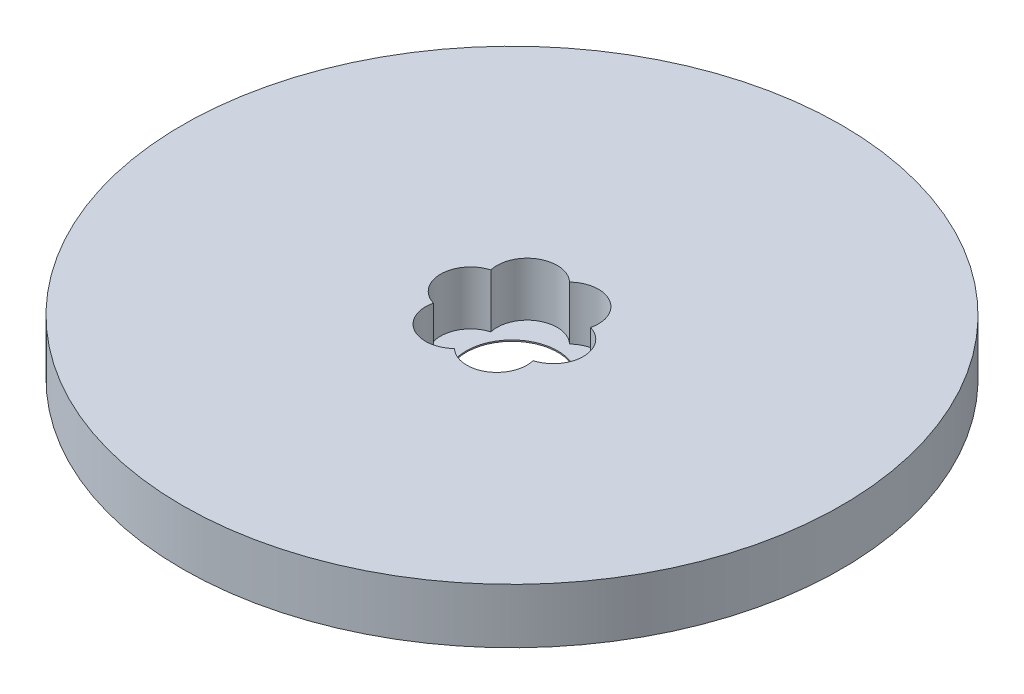
ISO-10303-21;
HEADER;
FILE_DESCRIPTION(('STEP AP214'),'2;1');
FILE_NAME('part.step','',(''),(''),'','','');
FILE_SCHEMA(('AUTOMOTIVE_DESIGN { 1 0 10303 214 1 1 1 1 }'));
ENDSEC;
DATA;
#1=APPLICATION_CONTEXT('core data for automotive mechanical design processes');
#2=APPLICATION_PROTOCOL_DEFINITION('international standard','automotive_design',2000,#1);
#3=PRODUCT_CONTEXT('',#1,'mechanical');
#4=PRODUCT('Part','Part','',(#3));
#5=PRODUCT_RELATED_PRODUCT_CATEGORY('part','',(#4));
#6=PRODUCT_DEFINITION_FORMATION('','',#4);
#7=PRODUCT_DEFINITION_CONTEXT('part definition',#1,'design');
#8=PRODUCT_DEFINITION('design','',#6,#7);
#9=PRODUCT_DEFINITION_SHAPE('','',#8);
#10=(LENGTH_UNIT() NAMED_UNIT(*) SI_UNIT(.MILLI.,.METRE.));
#11=(NAMED_UNIT(*) PLANE_ANGLE_UNIT() SI_UNIT($,.RADIAN.));
#12=(NAMED_UNIT(*) SI_UNIT($,.STERADIAN.) SOLID_ANGLE_UNIT());
#13=UNCERTAINTY_MEASURE_WITH_UNIT(LENGTH_MEASURE(1.E-05),#10,'distance_accuracy_value','');
#14=(GEOMETRIC_REPRESENTATION_CONTEXT(3) GLOBAL_UNCERTAINTY_ASSIGNED_CONTEXT((#13)) GLOBAL_UNIT_ASSIGNED_CONTEXT((#10,
#11,#12)) REPRESENTATION_CONTEXT('',''));
#15=CARTESIAN_POINT('',(0.,0.,0.));
#16=DIRECTION('',(0.,0.,1.));
#17=DIRECTION('',(1.,0.,0.));
#18=AXIS2_PLACEMENT_3D('',#15,#16,#17);
#19=CARTESIAN_POINT('',(0.,15.,0.));
#20=DIRECTION('',(0.,-1.,0.));
#21=DIRECTION('',(0.,0.,-1.));
#22=AXIS2_PLACEMENT_3D('',#19,#20,#21);
#23=CYLINDRICAL_SURFACE('',#22,12.5);
#24=CARTESIAN_POINT('',(0.,0.,0.));
#25=DIRECTION('',(0.,1.,0.));
#26=DIRECTION('',(0.,0.,1.));
#27=AXIS2_PLACEMENT_3D('',#24,#25,#26);
#28=CIRCLE('',#27,12.5);
#29=CARTESIAN_POINT('',(0.,0.,12.5));
#30=VERTEX_POINT('',#29);
#31=EDGE_CURVE('E142',#30,#30,#28,.T.);
#32=ORIENTED_EDGE('',*,*,#31,.F.);
#33=EDGE_LOOP('',(#32));
#34=FACE_BOUND('',#33,.T.);
#35=CARTESIAN_POINT('',(0.,0.338485779785127,0.));
#36=DIRECTION('',(0.,1.,0.));
#37=DIRECTION('',(0.,0.,1.));
#38=AXIS2_PLACEMENT_3D('',#35,#36,#37);
#39=CIRCLE('',#38,12.5);
#40=CARTESIAN_POINT('',(0.,0.338485779785127,12.5));
#41=VERTEX_POINT('',#40);
#42=EDGE_CURVE('E11',#41,#41,#39,.T.);
#43=ORIENTED_EDGE('',*,*,#42,.T.);
#44=EDGE_LOOP('',(#43));
#45=FACE_BOUND('',#44,.T.);
#46=ADVANCED_FACE('F39',(#34,#45),#23,.F.);
#47=CARTESIAN_POINT('',(0.,15.,0.));
#48=DIRECTION('',(0.,-1.,0.));
#49=DIRECTION('',(0.,0.,-1.));
#50=AXIS2_PLACEMENT_3D('',#47,#48,#49);
#51=CYLINDRICAL_SURFACE('',#50,90.);
#52=CARTESIAN_POINT('',(0.,15.,0.));
#53=DIRECTION('',(0.,1.,0.));
#54=DIRECTION('',(0.,0.,1.));
#55=AXIS2_PLACEMENT_3D('',#52,#53,#54);
#56=CIRCLE('',#55,90.);
#57=CARTESIAN_POINT('',(0.,15.,90.));
#58=VERTEX_POINT('',#57);
#59=EDGE_CURVE('E50',#58,#58,#56,.T.);
#60=ORIENTED_EDGE('',*,*,#59,.F.);
#61=EDGE_LOOP('',(#60));
#62=FACE_BOUND('',#61,.T.);
#63=CARTESIAN_POINT('',(0.,0.,0.));
#64=DIRECTION('',(0.,1.,0.));
#65=DIRECTION('',(0.,0.,1.));
#66=AXIS2_PLACEMENT_3D('',#63,#64,#65);
#67=CIRCLE('',#66,90.);
#68=CARTESIAN_POINT('',(0.,0.,90.));
#69=VERTEX_POINT('',#68);
#70=EDGE_CURVE('E150',#69,#69,#67,.T.);
#71=ORIENTED_EDGE('',*,*,#70,.T.);
#72=EDGE_LOOP('',(#71));
#73=FACE_BOUND('',#72,.T.);
#74=ADVANCED_FACE('F41',(#62,#73),#51,.T.);
#75=CARTESIAN_POINT('',(0.,15.,0.));
#76=DIRECTION('',(0.,1.,0.));
#77=DIRECTION('',(0.,0.,1.));
#78=AXIS2_PLACEMENT_3D('',#75,#76,#77);
#79=PLANE('',#78);
#80=CARTESIAN_POINT('',(-5.65166908655826,15.,9.78897800548534));
#81=DIRECTION('',(0.,1.,0.));
#82=DIRECTION('',(0.86602540378444,0.,0.499999999999998));
#83=AXIS2_PLACEMENT_3D('',#80,#81,#82);
#84=CIRCLE('',#83,8.19081502464406);
#85=CARTESIAN_POINT('',(-13.6118064528098,15.,7.85878011968683));
#86=VERTEX_POINT('',#85);
#87=CARTESIAN_POINT('',(0.,15.,15.7175602393736));
#88=VERTEX_POINT('',#87);
#89=EDGE_CURVE('E132',#86,#88,#84,.T.);
#90=ORIENTED_EDGE('',*,*,#89,.F.);
#91=CARTESIAN_POINT('',(-11.3033381731166,15.,0.));
#92=DIRECTION('',(0.,1.,0.));
#93=DIRECTION('',(0.,0.,1.));
#94=AXIS2_PLACEMENT_3D('',#91,#92,#93);
#95=CIRCLE('',#94,8.19081502464406);
#96=CARTESIAN_POINT('',(-13.6118064528099,15.,-7.85878011968679));
#97=VERTEX_POINT('',#96);
#98=EDGE_CURVE('E138',#97,#86,#95,.T.);
#99=ORIENTED_EDGE('',*,*,#98,.F.);
#100=CARTESIAN_POINT('',(-5.65166908655839,15.,-9.78897800548526));
#101=DIRECTION('',(0.,1.,0.));
#102=DIRECTION('',(-0.866025403784433,0.,0.50000000000001));
#103=AXIS2_PLACEMENT_3D('',#100,#101,#102);
#104=CIRCLE('',#103,8.19081502464406);
#105=CARTESIAN_POINT('',(-1.64798730217797E-13,15.,-15.7175602393736));
#106=VERTEX_POINT('',#105);
#107=EDGE_CURVE('E53',#106,#97,#104,.T.);
#108=ORIENTED_EDGE('',*,*,#107,.F.);
#109=CARTESIAN_POINT('',(5.65166908655819,15.,-9.78897800548538));
#110=DIRECTION('',(0.,1.,0.));
#111=DIRECTION('',(-0.866025403784443,0.,-0.499999999999992));
#112=AXIS2_PLACEMENT_3D('',#109,#110,#111);
#113=CIRCLE('',#112,8.19081502464406);
#114=CARTESIAN_POINT('',(13.6118064528097,15.,-7.85878011968686));
#115=VERTEX_POINT('',#114);
#116=EDGE_CURVE('E106',#115,#106,#113,.T.);
#117=ORIENTED_EDGE('',*,*,#116,.F.);
#118=CARTESIAN_POINT('',(11.3033381731166,15.,0.));
#119=DIRECTION('',(0.,1.,0.));
#120=DIRECTION('',(0.,0.,-1.));
#121=AXIS2_PLACEMENT_3D('',#118,#119,#120);
#122=CIRCLE('',#121,8.19081502464406);
#123=CARTESIAN_POINT('',(13.6118064528099,15.,7.85878011968681));
#124=VERTEX_POINT('',#123);
#125=EDGE_CURVE('E104',#124,#115,#122,.T.);
#126=ORIENTED_EDGE('',*,*,#125,.F.);
#127=CARTESIAN_POINT('',(5.65166908655833,15.,9.7889780054853));
#128=DIRECTION('',(0.,1.,0.));
#129=DIRECTION('',(0.866025403784436,0.,-0.500000000000004));
#130=AXIS2_PLACEMENT_3D('',#127,#128,#129);
#131=CIRCLE('',#130,8.19081502464406);
#132=EDGE_CURVE('E123',#88,#124,#131,.T.);
#133=ORIENTED_EDGE('',*,*,#132,.F.);
#134=EDGE_LOOP('',(#90,#99,#108,#117,#126,#133));
#135=FACE_BOUND('',#134,.T.);
#136=ORIENTED_EDGE('',*,*,#59,.T.);
#137=EDGE_LOOP('',(#136));
#138=FACE_BOUND('',#137,.T.);
#139=ADVANCED_FACE('F156',(#135,#138),#79,.T.);
#140=CARTESIAN_POINT('',(0.,0.,0.));
#141=DIRECTION('',(0.,1.,0.));
#142=DIRECTION('',(0.,0.,1.));
#143=AXIS2_PLACEMENT_3D('',#140,#141,#142);
#144=PLANE('',#143);
#145=ORIENTED_EDGE('',*,*,#31,.T.);
#146=EDGE_LOOP('',(#145));
#147=FACE_BOUND('',#146,.T.);
#148=ORIENTED_EDGE('',*,*,#70,.F.);
#149=EDGE_LOOP('',(#148));
#150=FACE_BOUND('',#149,.T.);
#151=ADVANCED_FACE('F153',(#147,#150),#144,.F.);
#152=CARTESIAN_POINT('',(-11.3033381731166,0.338485779785127,0.));
#153=DIRECTION('',(0.,1.,0.));
#154=DIRECTION('',(0.,0.,1.));
#155=AXIS2_PLACEMENT_3D('',#152,#153,#154);
#156=CYLINDRICAL_SURFACE('',#155,8.19081502464406);
#157=ORIENTED_EDGE('',*,*,#98,.T.);
#158=DIRECTION('',(0.,1.,0.));
#159=VECTOR('',#158,1.);
#160=CARTESIAN_POINT('',(-13.6118064528098,7.66924288989256,7.85878011968683));
#161=LINE('',#160,#159);
#162=CARTESIAN_POINT('',(-13.6118064528098,0.338485779785127,7.85878011968683));
#163=VERTEX_POINT('',#162);
#164=EDGE_CURVE('E65',#86,#163,#161,.F.);
#165=ORIENTED_EDGE('',*,*,#164,.T.);
#166=CARTESIAN_POINT('',(-11.3033381731166,0.338485779785127,0.));
#167=DIRECTION('',(0.,1.,0.));
#168=DIRECTION('',(0.,0.,1.));
#169=AXIS2_PLACEMENT_3D('',#166,#167,#168);
#170=CIRCLE('',#169,8.19081502464406);
#171=CARTESIAN_POINT('',(-13.6118064528099,0.338485779785127,-7.85878011968679));
#172=VERTEX_POINT('',#171);
#173=EDGE_CURVE('E139',#172,#163,#170,.T.);
#174=ORIENTED_EDGE('',*,*,#173,.F.);
#175=DIRECTION('',(0.,1.,0.));
#176=VECTOR('',#175,1.);
#177=CARTESIAN_POINT('',(-13.6118064528099,7.66924288989256,-7.85878011968679));
#178=LINE('',#177,#176);
#179=EDGE_CURVE('E114',#172,#97,#178,.T.);
#180=ORIENTED_EDGE('',*,*,#179,.T.);
#181=EDGE_LOOP('',(#157,#165,#174,#180));
#182=FACE_BOUND('',#181,.T.);
#183=ADVANCED_FACE('F154',(#182),#156,.F.);
#184=CARTESIAN_POINT('',(-11.3033381731166,0.338485779785127,0.));
#185=DIRECTION('',(0.,1.,0.));
#186=DIRECTION('',(0.,0.,1.));
#187=AXIS2_PLACEMENT_3D('',#184,#185,#186);
#188=PLANE('',#187);
#189=ORIENTED_EDGE('',*,*,#173,.T.);
#190=CARTESIAN_POINT('',(-5.65166908655826,0.338485779785127,9.78897800548534));
#191=DIRECTION('',(0.,1.,0.));
#192=DIRECTION('',(0.86602540378444,0.,0.499999999999998));
#193=AXIS2_PLACEMENT_3D('',#190,#191,#192);
#194=CIRCLE('',#193,8.19081502464406);
#195=CARTESIAN_POINT('',(0.,0.338485779785127,15.7175602393736));
#196=VERTEX_POINT('',#195);
#197=EDGE_CURVE('E133',#163,#196,#194,.T.);
#198=ORIENTED_EDGE('',*,*,#197,.T.);
#199=CARTESIAN_POINT('',(5.65166908655833,0.338485779785127,9.7889780054853));
#200=DIRECTION('',(0.,1.,0.));
#201=DIRECTION('',(0.866025403784436,0.,-0.500000000000004));
#202=AXIS2_PLACEMENT_3D('',#199,#200,#201);
#203=CIRCLE('',#202,8.19081502464406);
#204=CARTESIAN_POINT('',(13.6118064528099,0.338485779785127,7.85878011968681));
#205=VERTEX_POINT('',#204);
#206=EDGE_CURVE('E124',#196,#205,#203,.T.);
#207=ORIENTED_EDGE('',*,*,#206,.T.);
#208=CARTESIAN_POINT('',(11.3033381731166,0.338485779785127,0.));
#209=DIRECTION('',(0.,1.,0.));
#210=DIRECTION('',(0.,0.,-1.));
#211=AXIS2_PLACEMENT_3D('',#208,#209,#210);
#212=CIRCLE('',#211,8.19081502464406);
#213=CARTESIAN_POINT('',(13.6118064528097,0.338485779785127,-7.85878011968686));
#214=VERTEX_POINT('',#213);
#215=EDGE_CURVE('E105',#205,#214,#212,.T.);
#216=ORIENTED_EDGE('',*,*,#215,.T.);
#217=CARTESIAN_POINT('',(5.65166908655819,0.338485779785127,-9.78897800548538));
#218=DIRECTION('',(0.,1.,0.));
#219=DIRECTION('',(-0.866025403784443,0.,-0.499999999999992));
#220=AXIS2_PLACEMENT_3D('',#217,#218,#219);
#221=CIRCLE('',#220,8.19081502464406);
#222=CARTESIAN_POINT('',(-1.64798730217797E-13,0.338485779785127,-15.7175602393736));
#223=VERTEX_POINT('',#222);
#224=EDGE_CURVE('E91',#214,#223,#221,.T.);
#225=ORIENTED_EDGE('',*,*,#224,.T.);
#226=CARTESIAN_POINT('',(-5.65166908655839,0.338485779785127,-9.78897800548526));
#227=DIRECTION('',(0.,1.,0.));
#228=DIRECTION('',(-0.866025403784433,0.,0.50000000000001));
#229=AXIS2_PLACEMENT_3D('',#226,#227,#228);
#230=CIRCLE('',#229,8.19081502464406);
#231=EDGE_CURVE('E97',#223,#172,#230,.T.);
#232=ORIENTED_EDGE('',*,*,#231,.T.);
#233=EDGE_LOOP('',(#189,#198,#207,#216,#225,#232));
#234=FACE_BOUND('',#233,.T.);
#235=ORIENTED_EDGE('',*,*,#42,.F.);
#236=EDGE_LOOP('',(#235));
#237=FACE_BOUND('',#236,.T.);
#238=ADVANCED_FACE('F96',(#234,#237),#188,.T.);
#239=CARTESIAN_POINT('',(-5.65166908655826,0.338485779785127,9.78897800548534));
#240=DIRECTION('',(0.,1.,0.));
#241=DIRECTION('',(0.,0.,1.));
#242=AXIS2_PLACEMENT_3D('',#239,#240,#241);
#243=CYLINDRICAL_SURFACE('',#242,8.19081502464406);
#244=ORIENTED_EDGE('',*,*,#89,.T.);
#245=DIRECTION('',(0.,1.,0.));
#246=VECTOR('',#245,1.);
#247=CARTESIAN_POINT('',(0.,7.66924288989256,15.7175602393736));
#248=LINE('',#247,#246);
#249=EDGE_CURVE('E128',#88,#196,#248,.F.);
#250=ORIENTED_EDGE('',*,*,#249,.T.);
#251=ORIENTED_EDGE('',*,*,#197,.F.);
#252=ORIENTED_EDGE('',*,*,#164,.F.);
#253=EDGE_LOOP('',(#244,#250,#251,#252));
#254=FACE_BOUND('',#253,.T.);
#255=ADVANCED_FACE('F177',(#254),#243,.F.);
#256=CARTESIAN_POINT('',(-5.65166908655839,0.338485779785127,-9.78897800548526));
#257=DIRECTION('',(0.,1.,0.));
#258=DIRECTION('',(0.,0.,1.));
#259=AXIS2_PLACEMENT_3D('',#256,#257,#258);
#260=CYLINDRICAL_SURFACE('',#259,8.19081502464406);
#261=ORIENTED_EDGE('',*,*,#231,.F.);
#262=DIRECTION('',(0.,1.,0.));
#263=VECTOR('',#262,1.);
#264=CARTESIAN_POINT('',(-1.64798730217797E-13,7.66924288989256,-15.7175602393736));
#265=LINE('',#264,#263);
#266=EDGE_CURVE('E107',#106,#223,#265,.F.);
#267=ORIENTED_EDGE('',*,*,#266,.F.);
#268=ORIENTED_EDGE('',*,*,#107,.T.);
#269=ORIENTED_EDGE('',*,*,#179,.F.);
#270=EDGE_LOOP('',(#261,#267,#268,#269));
#271=FACE_BOUND('',#270,.T.);
#272=ADVANCED_FACE('F115',(#271),#260,.F.);
#273=CARTESIAN_POINT('',(5.65166908655833,0.338485779785127,9.7889780054853));
#274=DIRECTION('',(0.,1.,0.));
#275=DIRECTION('',(0.,0.,1.));
#276=AXIS2_PLACEMENT_3D('',#273,#274,#275);
#277=CYLINDRICAL_SURFACE('',#276,8.19081502464406);
#278=ORIENTED_EDGE('',*,*,#132,.T.);
#279=DIRECTION('',(0.,1.,0.));
#280=VECTOR('',#279,1.);
#281=CARTESIAN_POINT('',(13.6118064528099,7.66924288989256,7.85878011968681));
#282=LINE('',#281,#280);
#283=EDGE_CURVE('E118',#124,#205,#282,.F.);
#284=ORIENTED_EDGE('',*,*,#283,.T.);
#285=ORIENTED_EDGE('',*,*,#206,.F.);
#286=ORIENTED_EDGE('',*,*,#249,.F.);
#287=EDGE_LOOP('',(#278,#284,#285,#286));
#288=FACE_BOUND('',#287,.T.);
#289=ADVANCED_FACE('F182',(#288),#277,.F.);
#290=CARTESIAN_POINT('',(11.3033381731166,0.338485779785127,0.));
#291=DIRECTION('',(0.,1.,0.));
#292=DIRECTION('',(0.,0.,1.));
#293=AXIS2_PLACEMENT_3D('',#290,#291,#292);
#294=CYLINDRICAL_SURFACE('',#293,8.19081502464406);
#295=DIRECTION('',(0.,1.,0.));
#296=VECTOR('',#295,1.);
#297=CARTESIAN_POINT('',(13.6118064528097,7.66924288989256,-7.85878011968686));
#298=LINE('',#297,#296);
#299=EDGE_CURVE('E130',#115,#214,#298,.F.);
#300=ORIENTED_EDGE('',*,*,#299,.T.);
#301=ORIENTED_EDGE('',*,*,#215,.F.);
#302=ORIENTED_EDGE('',*,*,#283,.F.);
#303=ORIENTED_EDGE('',*,*,#125,.T.);
#304=EDGE_LOOP('',(#300,#301,#302,#303));
#305=FACE_BOUND('',#304,.T.);
#306=ADVANCED_FACE('F184',(#305),#294,.F.);
#307=CARTESIAN_POINT('',(5.65166908655819,0.338485779785127,-9.78897800548538));
#308=DIRECTION('',(0.,1.,0.));
#309=DIRECTION('',(0.,0.,1.));
#310=AXIS2_PLACEMENT_3D('',#307,#308,#309);
#311=CYLINDRICAL_SURFACE('',#310,8.19081502464406);
#312=ORIENTED_EDGE('',*,*,#116,.T.);
#313=ORIENTED_EDGE('',*,*,#266,.T.);
#314=ORIENTED_EDGE('',*,*,#224,.F.);
#315=ORIENTED_EDGE('',*,*,#299,.F.);
#316=EDGE_LOOP('',(#312,#313,#314,#315));
#317=FACE_BOUND('',#316,.T.);
#318=ADVANCED_FACE('F108',(#317),#311,.F.);
#319=CLOSED_SHELL('',(#46,#74,#139,#151,#183,#238,#255,#272,#289,#306,#318));
#320=MANIFOLD_SOLID_BREP('B2',#319);
#321=ADVANCED_BREP_SHAPE_REPRESENTATION('',(#18,#320),#14);
#322=SHAPE_DEFINITION_REPRESENTATION(#9,#321);
ENDSEC;
END-ISO-10303-21;
